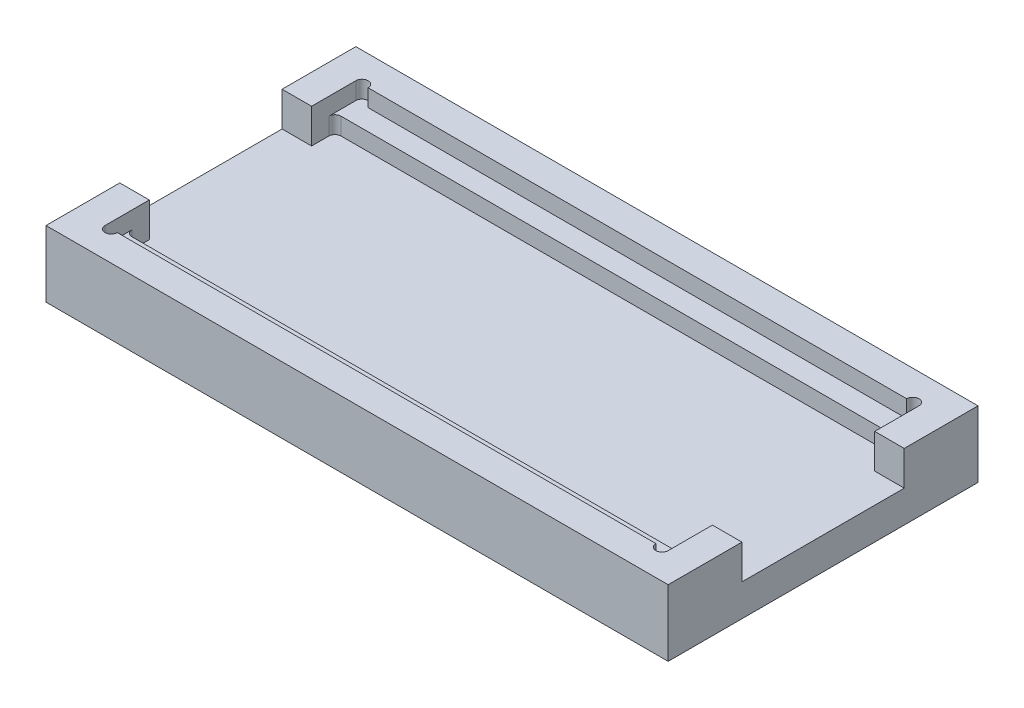
ISO-10303-21;
HEADER;
FILE_DESCRIPTION(('STEP AP214'),'2;1');
FILE_NAME('part.step','',(''),(''),'','','');
FILE_SCHEMA(('AUTOMOTIVE_DESIGN { 1 0 10303 214 1 1 1 1 }'));
ENDSEC;
DATA;
#1=APPLICATION_CONTEXT('core data for automotive mechanical design processes');
#2=APPLICATION_PROTOCOL_DEFINITION('international standard','automotive_design',2000,#1);
#3=PRODUCT_CONTEXT('',#1,'mechanical');
#4=PRODUCT('Part','Part','',(#3));
#5=PRODUCT_RELATED_PRODUCT_CATEGORY('part','',(#4));
#6=PRODUCT_DEFINITION_FORMATION('','',#4);
#7=PRODUCT_DEFINITION_CONTEXT('part definition',#1,'design');
#8=PRODUCT_DEFINITION('design','',#6,#7);
#9=PRODUCT_DEFINITION_SHAPE('','',#8);
#10=(LENGTH_UNIT() NAMED_UNIT(*) SI_UNIT(.MILLI.,.METRE.));
#11=(NAMED_UNIT(*) PLANE_ANGLE_UNIT() SI_UNIT($,.RADIAN.));
#12=(NAMED_UNIT(*) SI_UNIT($,.STERADIAN.) SOLID_ANGLE_UNIT());
#13=UNCERTAINTY_MEASURE_WITH_UNIT(LENGTH_MEASURE(1.E-05),#10,'distance_accuracy_value','');
#14=(GEOMETRIC_REPRESENTATION_CONTEXT(3) GLOBAL_UNCERTAINTY_ASSIGNED_CONTEXT((#13)) GLOBAL_UNIT_ASSIGNED_CONTEXT((#10,
#11,#12)) REPRESENTATION_CONTEXT('',''));
#15=CARTESIAN_POINT('',(0.,0.,0.));
#16=DIRECTION('',(0.,0.,1.));
#17=DIRECTION('',(1.,0.,0.));
#18=AXIS2_PLACEMENT_3D('',#15,#16,#17);
#19=CARTESIAN_POINT('',(0.,27.,0.));
#20=DIRECTION('',(0.,-1.,0.));
#21=DIRECTION('',(0.,0.,-1.));
#22=AXIS2_PLACEMENT_3D('',#19,#20,#21);
#23=PLANE('',#22);
#24=DIRECTION('',(0.,0.,-1.));
#25=VECTOR('',#24,1.);
#26=CARTESIAN_POINT('',(241.,27.,-114.));
#27=LINE('',#26,#25);
#28=CARTESIAN_POINT('',(241.,27.,-12.));
#29=VERTEX_POINT('',#28);
#30=CARTESIAN_POINT('',(241.,27.,-30.));
#31=VERTEX_POINT('',#30);
#32=EDGE_CURVE('E260',#29,#31,#27,.T.);
#33=ORIENTED_EDGE('',*,*,#32,.F.);
#34=CARTESIAN_POINT('',(238.5,27.,-12.));
#35=DIRECTION('',(0.,1.,0.));
#36=DIRECTION('',(0.,0.,-1.));
#37=AXIS2_PLACEMENT_3D('',#34,#35,#36);
#38=CIRCLE('',#37,2.5);
#39=CARTESIAN_POINT('',(236.,27.,-12.));
#40=VERTEX_POINT('',#39);
#41=EDGE_CURVE('E539',#40,#29,#38,.T.);
#42=ORIENTED_EDGE('',*,*,#41,.F.);
#43=DIRECTION('',(1.,0.,0.));
#44=VECTOR('',#43,1.);
#45=CARTESIAN_POINT('',(11.9999999999999,27.,-12.));
#46=LINE('',#45,#44);
#47=CARTESIAN_POINT('',(16.9999999999999,27.,-12.));
#48=VERTEX_POINT('',#47);
#49=EDGE_CURVE('E438',#48,#40,#46,.T.);
#50=ORIENTED_EDGE('',*,*,#49,.F.);
#51=CARTESIAN_POINT('',(14.4999999999999,27.,-12.));
#52=DIRECTION('',(0.,1.,0.));
#53=DIRECTION('',(0.,0.,1.));
#54=AXIS2_PLACEMENT_3D('',#51,#52,#53);
#55=CIRCLE('',#54,2.5);
#56=CARTESIAN_POINT('',(11.9999999999999,27.,-12.));
#57=VERTEX_POINT('',#56);
#58=EDGE_CURVE('E525',#57,#48,#55,.T.);
#59=ORIENTED_EDGE('',*,*,#58,.F.);
#60=DIRECTION('',(0.,0.,1.));
#61=VECTOR('',#60,1.);
#62=CARTESIAN_POINT('',(11.9999999999999,27.,-114.));
#63=LINE('',#62,#61);
#64=CARTESIAN_POINT('',(11.9999999999999,27.,-30.));
#65=VERTEX_POINT('',#64);
#66=EDGE_CURVE('E417',#65,#57,#63,.T.);
#67=ORIENTED_EDGE('',*,*,#66,.F.);
#68=DIRECTION('',(1.,0.,0.));
#69=VECTOR('',#68,1.);
#70=CARTESIAN_POINT('',(1.37667655053519E-13,27.,-30.));
#71=LINE('',#70,#69);
#72=CARTESIAN_POINT('',(1.37667655053519E-13,27.,-30.));
#73=VERTEX_POINT('',#72);
#74=EDGE_CURVE('E498',#73,#65,#71,.T.);
#75=ORIENTED_EDGE('',*,*,#74,.F.);
#76=DIRECTION('',(0.,0.,1.));
#77=VECTOR('',#76,1.);
#78=CARTESIAN_POINT('',(0.,27.,0.));
#79=LINE('',#78,#77);
#80=CARTESIAN_POINT('',(0.,27.,0.));
#81=VERTEX_POINT('',#80);
#82=EDGE_CURVE('E291',#73,#81,#79,.T.);
#83=ORIENTED_EDGE('',*,*,#82,.T.);
#84=DIRECTION('',(1.,0.,0.));
#85=VECTOR('',#84,1.);
#86=CARTESIAN_POINT('',(0.,27.,0.));
#87=LINE('',#86,#85);
#88=CARTESIAN_POINT('',(253.,27.,0.));
#89=VERTEX_POINT('',#88);
#90=EDGE_CURVE('E290',#81,#89,#87,.T.);
#91=ORIENTED_EDGE('',*,*,#90,.T.);
#92=DIRECTION('',(0.,0.,-1.));
#93=VECTOR('',#92,1.);
#94=CARTESIAN_POINT('',(253.,27.,0.));
#95=LINE('',#94,#93);
#96=CARTESIAN_POINT('',(253.,27.,-30.));
#97=VERTEX_POINT('',#96);
#98=EDGE_CURVE('E295',#89,#97,#95,.T.);
#99=ORIENTED_EDGE('',*,*,#98,.T.);
#100=DIRECTION('',(1.,0.,0.));
#101=VECTOR('',#100,1.);
#102=CARTESIAN_POINT('',(253.,27.,-30.));
#103=LINE('',#102,#101);
#104=EDGE_CURVE('E460',#31,#97,#103,.T.);
#105=ORIENTED_EDGE('',*,*,#104,.F.);
#106=EDGE_LOOP('',(#33,#42,#50,#59,#67,#75,#83,#91,#99,#105));
#107=FACE_BOUND('',#106,.T.);
#108=ADVANCED_FACE('F45',(#107),#23,.F.);
#109=CARTESIAN_POINT('',(241.,20.,-114.));
#110=DIRECTION('',(1.,0.,0.));
#111=DIRECTION('',(0.,0.,-1.));
#112=AXIS2_PLACEMENT_3D('',#109,#110,#111);
#113=PLANE('',#112);
#114=DIRECTION('',(0.,0.,-1.));
#115=VECTOR('',#114,1.);
#116=CARTESIAN_POINT('',(241.,13.,-105.5));
#117=LINE('',#116,#115);
#118=CARTESIAN_POINT('',(241.,13.,-23.));
#119=VERTEX_POINT('',#118);
#120=CARTESIAN_POINT('',(241.,13.,-30.));
#121=VERTEX_POINT('',#120);
#122=EDGE_CURVE('E411',#119,#121,#117,.T.);
#123=ORIENTED_EDGE('',*,*,#122,.F.);
#124=DIRECTION('',(0.,1.,0.));
#125=VECTOR('',#124,1.);
#126=CARTESIAN_POINT('',(241.,20.,-23.));
#127=LINE('',#126,#125);
#128=CARTESIAN_POINT('',(241.,20.,-23.));
#129=VERTEX_POINT('',#128);
#130=EDGE_CURVE('E330',#119,#129,#127,.T.);
#131=ORIENTED_EDGE('',*,*,#130,.T.);
#132=DIRECTION('',(0.,0.,-1.));
#133=VECTOR('',#132,1.);
#134=CARTESIAN_POINT('',(241.,20.,-114.));
#135=LINE('',#134,#133);
#136=CARTESIAN_POINT('',(241.,20.,-12.));
#137=VERTEX_POINT('',#136);
#138=EDGE_CURVE('E430',#137,#129,#135,.T.);
#139=ORIENTED_EDGE('',*,*,#138,.F.);
#140=DIRECTION('',(0.,1.,0.));
#141=VECTOR('',#140,1.);
#142=CARTESIAN_POINT('',(241.,20.,-12.));
#143=LINE('',#142,#141);
#144=EDGE_CURVE('E279',#137,#29,#143,.T.);
#145=ORIENTED_EDGE('',*,*,#144,.T.);
#146=ORIENTED_EDGE('',*,*,#32,.T.);
#147=DIRECTION('',(0.,1.,0.));
#148=VECTOR('',#147,1.);
#149=CARTESIAN_POINT('',(241.,13.,-30.));
#150=LINE('',#149,#148);
#151=EDGE_CURVE('E509',#121,#31,#150,.T.);
#152=ORIENTED_EDGE('',*,*,#151,.F.);
#153=EDGE_LOOP('',(#123,#131,#139,#145,#146,#152));
#154=FACE_BOUND('',#153,.T.);
#155=ADVANCED_FACE('F610',(#154),#113,.F.);
#156=CARTESIAN_POINT('',(11.9999999999999,20.,-114.));
#157=DIRECTION('',(-1.,0.,0.));
#158=DIRECTION('',(0.,0.,1.));
#159=AXIS2_PLACEMENT_3D('',#156,#157,#158);
#160=PLANE('',#159);
#161=DIRECTION('',(0.,0.,1.));
#162=VECTOR('',#161,1.);
#163=CARTESIAN_POINT('',(11.9999999999999,13.,-105.5));
#164=LINE('',#163,#162);
#165=CARTESIAN_POINT('',(11.9999999999999,13.,-103.));
#166=VERTEX_POINT('',#165);
#167=CARTESIAN_POINT('',(11.9999999999999,13.,-96.));
#168=VERTEX_POINT('',#167);
#169=EDGE_CURVE('E402',#166,#168,#164,.T.);
#170=ORIENTED_EDGE('',*,*,#169,.F.);
#171=DIRECTION('',(0.,1.,0.));
#172=VECTOR('',#171,1.);
#173=CARTESIAN_POINT('',(11.9999999999999,20.,-103.));
#174=LINE('',#173,#172);
#175=CARTESIAN_POINT('',(11.9999999999999,20.,-103.));
#176=VERTEX_POINT('',#175);
#177=EDGE_CURVE('E366',#166,#176,#174,.T.);
#178=ORIENTED_EDGE('',*,*,#177,.T.);
#179=DIRECTION('',(0.,0.,1.));
#180=VECTOR('',#179,1.);
#181=CARTESIAN_POINT('',(11.9999999999999,20.,-114.));
#182=LINE('',#181,#180);
#183=CARTESIAN_POINT('',(11.9999999999999,20.,-114.));
#184=VERTEX_POINT('',#183);
#185=EDGE_CURVE('E60',#184,#176,#182,.T.);
#186=ORIENTED_EDGE('',*,*,#185,.F.);
#187=DIRECTION('',(0.,1.,0.));
#188=VECTOR('',#187,1.);
#189=CARTESIAN_POINT('',(11.9999999999999,20.,-114.));
#190=LINE('',#189,#188);
#191=CARTESIAN_POINT('',(11.9999999999999,27.,-114.));
#192=VERTEX_POINT('',#191);
#193=EDGE_CURVE('E272',#184,#192,#190,.T.);
#194=ORIENTED_EDGE('',*,*,#193,.T.);
#195=CARTESIAN_POINT('',(11.9999999999999,27.,-96.));
#196=VERTEX_POINT('',#195);
#197=EDGE_CURVE('E435',#192,#196,#63,.T.);
#198=ORIENTED_EDGE('',*,*,#197,.T.);
#199=DIRECTION('',(0.,1.,0.));
#200=VECTOR('',#199,1.);
#201=CARTESIAN_POINT('',(11.9999999999999,13.,-96.));
#202=LINE('',#201,#200);
#203=EDGE_CURVE('E477',#168,#196,#202,.T.);
#204=ORIENTED_EDGE('',*,*,#203,.F.);
#205=EDGE_LOOP('',(#170,#178,#186,#194,#198,#204));
#206=FACE_BOUND('',#205,.T.);
#207=ADVANCED_FACE('F566',(#206),#160,.F.);
#208=CARTESIAN_POINT('',(0.,20.,0.));
#209=DIRECTION('',(0.,1.,0.));
#210=DIRECTION('',(0.,0.,1.));
#211=AXIS2_PLACEMENT_3D('',#208,#209,#210);
#212=PLANE('',#211);
#213=DIRECTION('',(-1.,0.,0.));
#214=VECTOR('',#213,1.);
#215=CARTESIAN_POINT('',(241.,20.,-105.5));
#216=LINE('',#215,#214);
#217=CARTESIAN_POINT('',(238.5,20.,-105.5));
#218=VERTEX_POINT('',#217);
#219=CARTESIAN_POINT('',(14.4999999999999,20.,-105.5));
#220=VERTEX_POINT('',#219);
#221=EDGE_CURVE('E418',#218,#220,#216,.T.);
#222=ORIENTED_EDGE('',*,*,#221,.F.);
#223=CARTESIAN_POINT('',(238.5,20.,-103.));
#224=DIRECTION('',(0.,1.,0.));
#225=DIRECTION('',(0.,0.,1.));
#226=AXIS2_PLACEMENT_3D('',#223,#224,#225);
#227=CIRCLE('',#226,2.5);
#228=CARTESIAN_POINT('',(241.,20.,-103.));
#229=VERTEX_POINT('',#228);
#230=EDGE_CURVE('E373',#218,#229,#227,.F.);
#231=ORIENTED_EDGE('',*,*,#230,.T.);
#232=CARTESIAN_POINT('',(241.,20.,-114.));
#233=VERTEX_POINT('',#232);
#234=EDGE_CURVE('E429',#229,#233,#135,.T.);
#235=ORIENTED_EDGE('',*,*,#234,.T.);
#236=CARTESIAN_POINT('',(238.5,20.,-114.));
#237=DIRECTION('',(0.,1.,0.));
#238=DIRECTION('',(0.,0.,1.));
#239=AXIS2_PLACEMENT_3D('',#236,#237,#238);
#240=CIRCLE('',#239,2.5);
#241=CARTESIAN_POINT('',(236.,20.,-114.));
#242=VERTEX_POINT('',#241);
#243=EDGE_CURVE('E253',#242,#233,#240,.F.);
#244=ORIENTED_EDGE('',*,*,#243,.F.);
#245=DIRECTION('',(-1.,0.,0.));
#246=VECTOR('',#245,1.);
#247=CARTESIAN_POINT('',(11.9999999999999,20.,-114.));
#248=LINE('',#247,#246);
#249=CARTESIAN_POINT('',(16.9999999999999,20.,-114.));
#250=VERTEX_POINT('',#249);
#251=EDGE_CURVE('E251',#242,#250,#248,.T.);
#252=ORIENTED_EDGE('',*,*,#251,.T.);
#253=CARTESIAN_POINT('',(14.4999999999999,20.,-114.));
#254=DIRECTION('',(0.,1.,0.));
#255=DIRECTION('',(0.,0.,1.));
#256=AXIS2_PLACEMENT_3D('',#253,#254,#255);
#257=CIRCLE('',#256,2.5);
#258=EDGE_CURVE('E534',#184,#250,#257,.F.);
#259=ORIENTED_EDGE('',*,*,#258,.F.);
#260=ORIENTED_EDGE('',*,*,#185,.T.);
#261=CARTESIAN_POINT('',(14.4999999999999,20.,-103.));
#262=DIRECTION('',(0.,1.,0.));
#263=DIRECTION('',(0.,0.,1.));
#264=AXIS2_PLACEMENT_3D('',#261,#262,#263);
#265=CIRCLE('',#264,2.5);
#266=EDGE_CURVE('E12',#176,#220,#265,.F.);
#267=ORIENTED_EDGE('',*,*,#266,.T.);
#268=EDGE_LOOP('',(#222,#231,#235,#244,#252,#259,#260,#267));
#269=FACE_BOUND('',#268,.T.);
#270=ADVANCED_FACE('F550',(#269),#212,.T.);
#271=CARTESIAN_POINT('',(0.,27.,0.));
#272=DIRECTION('',(1.,0.,0.));
#273=DIRECTION('',(0.,0.,-1.));
#274=AXIS2_PLACEMENT_3D('',#271,#272,#273);
#275=PLANE('',#274);
#276=DIRECTION('',(0.,0.,1.));
#277=VECTOR('',#276,1.);
#278=CARTESIAN_POINT('',(1.37667655053519E-13,13.,-30.));
#279=LINE('',#278,#277);
#280=CARTESIAN_POINT('',(0.,13.,-96.));
#281=VERTEX_POINT('',#280);
#282=CARTESIAN_POINT('',(1.37667655053519E-13,13.,-30.));
#283=VERTEX_POINT('',#282);
#284=EDGE_CURVE('E473',#281,#283,#279,.T.);
#285=ORIENTED_EDGE('',*,*,#284,.F.);
#286=DIRECTION('',(0.,1.,0.));
#287=VECTOR('',#286,1.);
#288=CARTESIAN_POINT('',(0.,13.,-96.));
#289=LINE('',#288,#287);
#290=CARTESIAN_POINT('',(0.,27.,-96.));
#291=VERTEX_POINT('',#290);
#292=EDGE_CURVE('E422',#281,#291,#289,.T.);
#293=ORIENTED_EDGE('',*,*,#292,.T.);
#294=CARTESIAN_POINT('',(0.,27.,-126.));
#295=VERTEX_POINT('',#294);
#296=EDGE_CURVE('E286',#295,#291,#79,.T.);
#297=ORIENTED_EDGE('',*,*,#296,.F.);
#298=DIRECTION('',(0.,-1.,0.));
#299=VECTOR('',#298,1.);
#300=CARTESIAN_POINT('',(0.,27.,-126.));
#301=LINE('',#300,#299);
#302=CARTESIAN_POINT('',(0.,0.,-126.));
#303=VERTEX_POINT('',#302);
#304=EDGE_CURVE('E302',#295,#303,#301,.T.);
#305=ORIENTED_EDGE('',*,*,#304,.T.);
#306=DIRECTION('',(0.,0.,1.));
#307=VECTOR('',#306,1.);
#308=CARTESIAN_POINT('',(0.,0.,0.));
#309=LINE('',#308,#307);
#310=CARTESIAN_POINT('',(0.,0.,0.));
#311=VERTEX_POINT('',#310);
#312=EDGE_CURVE('E276',#303,#311,#309,.T.);
#313=ORIENTED_EDGE('',*,*,#312,.T.);
#314=DIRECTION('',(0.,-1.,0.));
#315=VECTOR('',#314,1.);
#316=CARTESIAN_POINT('',(0.,27.,0.));
#317=LINE('',#316,#315);
#318=EDGE_CURVE('E326',#81,#311,#317,.T.);
#319=ORIENTED_EDGE('',*,*,#318,.F.);
#320=ORIENTED_EDGE('',*,*,#82,.F.);
#321=DIRECTION('',(0.,1.,0.));
#322=VECTOR('',#321,1.);
#323=CARTESIAN_POINT('',(1.37667655053519E-13,13.,-30.));
#324=LINE('',#323,#322);
#325=EDGE_CURVE('E489',#283,#73,#324,.T.);
#326=ORIENTED_EDGE('',*,*,#325,.F.);
#327=EDGE_LOOP('',(#285,#293,#297,#305,#313,#319,#320,#326));
#328=FACE_BOUND('',#327,.T.);
#329=ADVANCED_FACE('F575',(#328),#275,.F.);
#330=CARTESIAN_POINT('',(0.,27.,0.));
#331=DIRECTION('',(0.,0.,-1.));
#332=DIRECTION('',(-1.,0.,0.));
#333=AXIS2_PLACEMENT_3D('',#330,#331,#332);
#334=PLANE('',#333);
#335=DIRECTION('',(1.,0.,0.));
#336=VECTOR('',#335,1.);
#337=CARTESIAN_POINT('',(0.,0.,0.));
#338=LINE('',#337,#336);
#339=CARTESIAN_POINT('',(253.,0.,0.));
#340=VERTEX_POINT('',#339);
#341=EDGE_CURVE('E306',#311,#340,#338,.T.);
#342=ORIENTED_EDGE('',*,*,#341,.T.);
#343=DIRECTION('',(0.,-1.,0.));
#344=VECTOR('',#343,1.);
#345=CARTESIAN_POINT('',(253.,27.,0.));
#346=LINE('',#345,#344);
#347=EDGE_CURVE('E322',#89,#340,#346,.T.);
#348=ORIENTED_EDGE('',*,*,#347,.F.);
#349=ORIENTED_EDGE('',*,*,#90,.F.);
#350=ORIENTED_EDGE('',*,*,#318,.T.);
#351=EDGE_LOOP('',(#342,#348,#349,#350));
#352=FACE_BOUND('',#351,.T.);
#353=ADVANCED_FACE('F589',(#352),#334,.F.);
#354=CARTESIAN_POINT('',(253.,27.,0.));
#355=DIRECTION('',(-1.,0.,0.));
#356=DIRECTION('',(0.,0.,1.));
#357=AXIS2_PLACEMENT_3D('',#354,#355,#356);
#358=PLANE('',#357);
#359=DIRECTION('',(0.,0.,-1.));
#360=VECTOR('',#359,1.);
#361=CARTESIAN_POINT('',(253.,13.,-96.));
#362=LINE('',#361,#360);
#363=CARTESIAN_POINT('',(253.,13.,-30.));
#364=VERTEX_POINT('',#363);
#365=CARTESIAN_POINT('',(253.,13.,-96.));
#366=VERTEX_POINT('',#365);
#367=EDGE_CURVE('E515',#364,#366,#362,.T.);
#368=ORIENTED_EDGE('',*,*,#367,.F.);
#369=DIRECTION('',(0.,1.,0.));
#370=VECTOR('',#369,1.);
#371=CARTESIAN_POINT('',(253.,13.,-30.));
#372=LINE('',#371,#370);
#373=EDGE_CURVE('E500',#364,#97,#372,.T.);
#374=ORIENTED_EDGE('',*,*,#373,.T.);
#375=ORIENTED_EDGE('',*,*,#98,.F.);
#376=ORIENTED_EDGE('',*,*,#347,.T.);
#377=DIRECTION('',(0.,0.,-1.));
#378=VECTOR('',#377,1.);
#379=CARTESIAN_POINT('',(253.,0.,0.));
#380=LINE('',#379,#378);
#381=CARTESIAN_POINT('',(253.,0.,-126.));
#382=VERTEX_POINT('',#381);
#383=EDGE_CURVE('E309',#340,#382,#380,.T.);
#384=ORIENTED_EDGE('',*,*,#383,.T.);
#385=DIRECTION('',(0.,-1.,0.));
#386=VECTOR('',#385,1.);
#387=CARTESIAN_POINT('',(253.,27.,-126.));
#388=LINE('',#387,#386);
#389=CARTESIAN_POINT('',(253.,27.,-126.));
#390=VERTEX_POINT('',#389);
#391=EDGE_CURVE('E318',#390,#382,#388,.T.);
#392=ORIENTED_EDGE('',*,*,#391,.F.);
#393=CARTESIAN_POINT('',(253.,27.,-96.));
#394=VERTEX_POINT('',#393);
#395=EDGE_CURVE('E294',#394,#390,#95,.T.);
#396=ORIENTED_EDGE('',*,*,#395,.F.);
#397=DIRECTION('',(0.,1.,0.));
#398=VECTOR('',#397,1.);
#399=CARTESIAN_POINT('',(253.,13.,-96.));
#400=LINE('',#399,#398);
#401=EDGE_CURVE('E467',#366,#394,#400,.T.);
#402=ORIENTED_EDGE('',*,*,#401,.F.);
#403=EDGE_LOOP('',(#368,#374,#375,#376,#384,#392,#396,#402));
#404=FACE_BOUND('',#403,.T.);
#405=ADVANCED_FACE('F466',(#404),#358,.F.);
#406=CARTESIAN_POINT('',(0.,27.,-126.));
#407=DIRECTION('',(0.,0.,1.));
#408=DIRECTION('',(1.,0.,0.));
#409=AXIS2_PLACEMENT_3D('',#406,#407,#408);
#410=PLANE('',#409);
#411=DIRECTION('',(-1.,0.,0.));
#412=VECTOR('',#411,1.);
#413=CARTESIAN_POINT('',(0.,0.,-126.));
#414=LINE('',#413,#412);
#415=EDGE_CURVE('E312',#382,#303,#414,.T.);
#416=ORIENTED_EDGE('',*,*,#415,.T.);
#417=ORIENTED_EDGE('',*,*,#304,.F.);
#418=DIRECTION('',(-1.,0.,0.));
#419=VECTOR('',#418,1.);
#420=CARTESIAN_POINT('',(0.,27.,-126.));
#421=LINE('',#420,#419);
#422=EDGE_CURVE('E299',#390,#295,#421,.T.);
#423=ORIENTED_EDGE('',*,*,#422,.F.);
#424=ORIENTED_EDGE('',*,*,#391,.T.);
#425=EDGE_LOOP('',(#416,#417,#423,#424));
#426=FACE_BOUND('',#425,.T.);
#427=ADVANCED_FACE('F579',(#426),#410,.F.);
#428=ORIENTED_EDGE('',*,*,#197,.F.);
#429=CARTESIAN_POINT('',(14.4999999999999,27.,-114.));
#430=DIRECTION('',(0.,1.,0.));
#431=DIRECTION('',(0.,0.,-1.));
#432=AXIS2_PLACEMENT_3D('',#429,#430,#431);
#433=CIRCLE('',#432,2.5);
#434=CARTESIAN_POINT('',(16.9999999999999,27.,-114.));
#435=VERTEX_POINT('',#434);
#436=EDGE_CURVE('E258',#435,#192,#433,.T.);
#437=ORIENTED_EDGE('',*,*,#436,.F.);
#438=DIRECTION('',(-1.,0.,0.));
#439=VECTOR('',#438,1.);
#440=CARTESIAN_POINT('',(11.9999999999999,27.,-114.));
#441=LINE('',#440,#439);
#442=CARTESIAN_POINT('',(236.,27.,-114.));
#443=VERTEX_POINT('',#442);
#444=EDGE_CURVE('E249',#443,#435,#441,.T.);
#445=ORIENTED_EDGE('',*,*,#444,.F.);
#446=CARTESIAN_POINT('',(238.5,27.,-114.));
#447=DIRECTION('',(0.,1.,0.));
#448=DIRECTION('',(0.,0.,1.));
#449=AXIS2_PLACEMENT_3D('',#446,#447,#448);
#450=CIRCLE('',#449,2.5);
#451=CARTESIAN_POINT('',(241.,27.,-114.));
#452=VERTEX_POINT('',#451);
#453=EDGE_CURVE('E232',#452,#443,#450,.T.);
#454=ORIENTED_EDGE('',*,*,#453,.F.);
#455=CARTESIAN_POINT('',(241.,27.,-96.));
#456=VERTEX_POINT('',#455);
#457=EDGE_CURVE('E268',#456,#452,#27,.T.);
#458=ORIENTED_EDGE('',*,*,#457,.F.);
#459=DIRECTION('',(-1.,0.,0.));
#460=VECTOR('',#459,1.);
#461=CARTESIAN_POINT('',(253.,27.,-96.));
#462=LINE('',#461,#460);
#463=EDGE_CURVE('E455',#394,#456,#462,.T.);
#464=ORIENTED_EDGE('',*,*,#463,.F.);
#465=ORIENTED_EDGE('',*,*,#395,.T.);
#466=ORIENTED_EDGE('',*,*,#422,.T.);
#467=ORIENTED_EDGE('',*,*,#296,.T.);
#468=DIRECTION('',(-1.,0.,0.));
#469=VECTOR('',#468,1.);
#470=CARTESIAN_POINT('',(0.,27.,-96.));
#471=LINE('',#470,#469);
#472=EDGE_CURVE('E475',#196,#291,#471,.T.);
#473=ORIENTED_EDGE('',*,*,#472,.F.);
#474=EDGE_LOOP('',(#428,#437,#445,#454,#458,#464,#465,#466,#467,#473));
#475=FACE_BOUND('',#474,.T.);
#476=ADVANCED_FACE('F257',(#475),#23,.F.);
#477=CARTESIAN_POINT('',(0.,0.,0.));
#478=DIRECTION('',(0.,-1.,0.));
#479=DIRECTION('',(0.,0.,-1.));
#480=AXIS2_PLACEMENT_3D('',#477,#478,#479);
#481=PLANE('',#480);
#482=ORIENTED_EDGE('',*,*,#312,.F.);
#483=ORIENTED_EDGE('',*,*,#415,.F.);
#484=ORIENTED_EDGE('',*,*,#383,.F.);
#485=ORIENTED_EDGE('',*,*,#341,.F.);
#486=EDGE_LOOP('',(#482,#483,#484,#485));
#487=FACE_BOUND('',#486,.T.);
#488=ADVANCED_FACE('F584',(#487),#481,.T.);
#489=CARTESIAN_POINT('',(11.9999999999999,20.,-23.));
#490=VERTEX_POINT('',#489);
#491=CARTESIAN_POINT('',(11.9999999999999,20.,-12.));
#492=VERTEX_POINT('',#491);
#493=EDGE_CURVE('E68',#490,#492,#182,.T.);
#494=ORIENTED_EDGE('',*,*,#493,.F.);
#495=DIRECTION('',(0.,1.,0.));
#496=VECTOR('',#495,1.);
#497=CARTESIAN_POINT('',(11.9999999999999,13.,-23.));
#498=LINE('',#497,#496);
#499=CARTESIAN_POINT('',(11.9999999999999,13.,-23.));
#500=VERTEX_POINT('',#499);
#501=EDGE_CURVE('E363',#490,#500,#498,.F.);
#502=ORIENTED_EDGE('',*,*,#501,.T.);
#503=CARTESIAN_POINT('',(11.9999999999999,13.,-30.));
#504=VERTEX_POINT('',#503);
#505=EDGE_CURVE('E393',#504,#500,#164,.T.);
#506=ORIENTED_EDGE('',*,*,#505,.F.);
#507=DIRECTION('',(0.,1.,0.));
#508=VECTOR('',#507,1.);
#509=CARTESIAN_POINT('',(11.9999999999999,13.,-30.));
#510=LINE('',#509,#508);
#511=EDGE_CURVE('E479',#504,#65,#510,.T.);
#512=ORIENTED_EDGE('',*,*,#511,.T.);
#513=ORIENTED_EDGE('',*,*,#66,.T.);
#514=DIRECTION('',(0.,1.,0.));
#515=VECTOR('',#514,1.);
#516=CARTESIAN_POINT('',(11.9999999999999,20.,-12.));
#517=LINE('',#516,#515);
#518=EDGE_CURVE('E283',#492,#57,#517,.T.);
#519=ORIENTED_EDGE('',*,*,#518,.F.);
#520=EDGE_LOOP('',(#494,#502,#506,#512,#513,#519));
#521=FACE_BOUND('',#520,.T.);
#522=ADVANCED_FACE('F391',(#521),#160,.F.);
#523=CARTESIAN_POINT('',(11.9999999999999,20.,-114.));
#524=DIRECTION('',(0.,0.,-1.));
#525=DIRECTION('',(-1.,0.,0.));
#526=AXIS2_PLACEMENT_3D('',#523,#524,#525);
#527=PLANE('',#526);
#528=ORIENTED_EDGE('',*,*,#444,.T.);
#529=DIRECTION('',(0.,1.,0.));
#530=VECTOR('',#529,1.);
#531=CARTESIAN_POINT('',(16.9999999999999,14.4098300562505,-114.));
#532=LINE('',#531,#530);
#533=EDGE_CURVE('E531',#250,#435,#532,.T.);
#534=ORIENTED_EDGE('',*,*,#533,.F.);
#535=ORIENTED_EDGE('',*,*,#251,.F.);
#536=DIRECTION('',(0.,1.,0.));
#537=VECTOR('',#536,1.);
#538=CARTESIAN_POINT('',(236.,14.4098300562505,-114.));
#539=LINE('',#538,#537);
#540=EDGE_CURVE('E235',#242,#443,#539,.T.);
#541=ORIENTED_EDGE('',*,*,#540,.T.);
#542=EDGE_LOOP('',(#528,#534,#535,#541));
#543=FACE_BOUND('',#542,.T.);
#544=ADVANCED_FACE('F247',(#543),#527,.F.);
#545=ORIENTED_EDGE('',*,*,#234,.F.);
#546=DIRECTION('',(0.,1.,0.));
#547=VECTOR('',#546,1.);
#548=CARTESIAN_POINT('',(241.,13.,-103.));
#549=LINE('',#548,#547);
#550=CARTESIAN_POINT('',(241.,13.,-103.));
#551=VERTEX_POINT('',#550);
#552=EDGE_CURVE('E360',#229,#551,#549,.F.);
#553=ORIENTED_EDGE('',*,*,#552,.T.);
#554=CARTESIAN_POINT('',(241.,13.,-96.));
#555=VERTEX_POINT('',#554);
#556=EDGE_CURVE('E423',#555,#551,#117,.T.);
#557=ORIENTED_EDGE('',*,*,#556,.F.);
#558=DIRECTION('',(0.,1.,0.));
#559=VECTOR('',#558,1.);
#560=CARTESIAN_POINT('',(241.,13.,-96.));
#561=LINE('',#560,#559);
#562=EDGE_CURVE('E453',#555,#456,#561,.T.);
#563=ORIENTED_EDGE('',*,*,#562,.T.);
#564=ORIENTED_EDGE('',*,*,#457,.T.);
#565=DIRECTION('',(0.,1.,0.));
#566=VECTOR('',#565,1.);
#567=CARTESIAN_POINT('',(241.,20.,-114.));
#568=LINE('',#567,#566);
#569=EDGE_CURVE('E238',#233,#452,#568,.T.);
#570=ORIENTED_EDGE('',*,*,#569,.F.);
#571=EDGE_LOOP('',(#545,#553,#557,#563,#564,#570));
#572=FACE_BOUND('',#571,.T.);
#573=ADVANCED_FACE('F450',(#572),#113,.F.);
#574=CARTESIAN_POINT('',(11.9999999999999,20.,-12.));
#575=DIRECTION('',(0.,0.,1.));
#576=DIRECTION('',(1.,0.,0.));
#577=AXIS2_PLACEMENT_3D('',#574,#575,#576);
#578=PLANE('',#577);
#579=ORIENTED_EDGE('',*,*,#49,.T.);
#580=DIRECTION('',(0.,1.,0.));
#581=VECTOR('',#580,1.);
#582=CARTESIAN_POINT('',(236.,14.4098300562505,-12.));
#583=LINE('',#582,#581);
#584=CARTESIAN_POINT('',(236.,20.,-12.));
#585=VERTEX_POINT('',#584);
#586=EDGE_CURVE('E540',#585,#40,#583,.T.);
#587=ORIENTED_EDGE('',*,*,#586,.F.);
#588=DIRECTION('',(1.,0.,0.));
#589=VECTOR('',#588,1.);
#590=CARTESIAN_POINT('',(11.9999999999999,20.,-12.));
#591=LINE('',#590,#589);
#592=CARTESIAN_POINT('',(16.9999999999999,20.,-12.));
#593=VERTEX_POINT('',#592);
#594=EDGE_CURVE('E426',#593,#585,#591,.T.);
#595=ORIENTED_EDGE('',*,*,#594,.F.);
#596=DIRECTION('',(0.,1.,0.));
#597=VECTOR('',#596,1.);
#598=CARTESIAN_POINT('',(16.9999999999999,14.4098300562505,-12.));
#599=LINE('',#598,#597);
#600=EDGE_CURVE('E471',#593,#48,#599,.T.);
#601=ORIENTED_EDGE('',*,*,#600,.T.);
#602=EDGE_LOOP('',(#579,#587,#595,#601));
#603=FACE_BOUND('',#602,.T.);
#604=ADVANCED_FACE('F760',(#603),#578,.F.);
#605=DIRECTION('',(1.,0.,0.));
#606=VECTOR('',#605,1.);
#607=CARTESIAN_POINT('',(241.,20.,-20.5));
#608=LINE('',#607,#606);
#609=CARTESIAN_POINT('',(14.4999999999999,20.,-20.5));
#610=VERTEX_POINT('',#609);
#611=CARTESIAN_POINT('',(238.5,20.,-20.5));
#612=VERTEX_POINT('',#611);
#613=EDGE_CURVE('E384',#610,#612,#608,.T.);
#614=ORIENTED_EDGE('',*,*,#613,.F.);
#615=CARTESIAN_POINT('',(14.4999999999999,20.,-23.));
#616=DIRECTION('',(0.,1.,0.));
#617=DIRECTION('',(0.,0.,1.));
#618=AXIS2_PLACEMENT_3D('',#615,#616,#617);
#619=CIRCLE('',#618,2.5);
#620=EDGE_CURVE('E54',#610,#490,#619,.F.);
#621=ORIENTED_EDGE('',*,*,#620,.T.);
#622=ORIENTED_EDGE('',*,*,#493,.T.);
#623=CARTESIAN_POINT('',(14.4999999999999,20.,-12.));
#624=DIRECTION('',(0.,1.,0.));
#625=DIRECTION('',(0.,0.,1.));
#626=AXIS2_PLACEMENT_3D('',#623,#624,#625);
#627=CIRCLE('',#626,2.5);
#628=EDGE_CURVE('E461',#593,#492,#627,.F.);
#629=ORIENTED_EDGE('',*,*,#628,.F.);
#630=ORIENTED_EDGE('',*,*,#594,.T.);
#631=CARTESIAN_POINT('',(238.5,20.,-12.));
#632=DIRECTION('',(0.,1.,0.));
#633=DIRECTION('',(0.,0.,1.));
#634=AXIS2_PLACEMENT_3D('',#631,#632,#633);
#635=CIRCLE('',#634,2.5);
#636=EDGE_CURVE('E528',#137,#585,#635,.F.);
#637=ORIENTED_EDGE('',*,*,#636,.F.);
#638=ORIENTED_EDGE('',*,*,#138,.T.);
#639=CARTESIAN_POINT('',(238.5,20.,-23.));
#640=DIRECTION('',(0.,1.,0.));
#641=DIRECTION('',(0.,0.,1.));
#642=AXIS2_PLACEMENT_3D('',#639,#640,#641);
#643=CIRCLE('',#642,2.5);
#644=EDGE_CURVE('E370',#129,#612,#643,.F.);
#645=ORIENTED_EDGE('',*,*,#644,.T.);
#646=EDGE_LOOP('',(#614,#621,#622,#629,#630,#637,#638,#645));
#647=FACE_BOUND('',#646,.T.);
#648=ADVANCED_FACE('F381',(#647),#212,.T.);
#649=CARTESIAN_POINT('',(241.,13.,-20.5));
#650=DIRECTION('',(0.,0.,1.));
#651=DIRECTION('',(1.,0.,0.));
#652=AXIS2_PLACEMENT_3D('',#649,#650,#651);
#653=PLANE('',#652);
#654=ORIENTED_EDGE('',*,*,#613,.T.);
#655=DIRECTION('',(0.,1.,0.));
#656=VECTOR('',#655,1.);
#657=CARTESIAN_POINT('',(238.5,13.,-20.5));
#658=LINE('',#657,#656);
#659=CARTESIAN_POINT('',(238.5,13.,-20.5));
#660=VERTEX_POINT('',#659);
#661=EDGE_CURVE('E338',#612,#660,#658,.F.);
#662=ORIENTED_EDGE('',*,*,#661,.T.);
#663=DIRECTION('',(1.,0.,0.));
#664=VECTOR('',#663,1.);
#665=CARTESIAN_POINT('',(241.,13.,-20.5));
#666=LINE('',#665,#664);
#667=CARTESIAN_POINT('',(14.4999999999999,13.,-20.5));
#668=VERTEX_POINT('',#667);
#669=EDGE_CURVE('E408',#668,#660,#666,.T.);
#670=ORIENTED_EDGE('',*,*,#669,.F.);
#671=DIRECTION('',(0.,1.,0.));
#672=VECTOR('',#671,1.);
#673=CARTESIAN_POINT('',(14.4999999999999,20.,-20.5));
#674=LINE('',#673,#672);
#675=EDGE_CURVE('E334',#668,#610,#674,.T.);
#676=ORIENTED_EDGE('',*,*,#675,.T.);
#677=EDGE_LOOP('',(#654,#662,#670,#676));
#678=FACE_BOUND('',#677,.T.);
#679=ADVANCED_FACE('F619',(#678),#653,.F.);
#680=CARTESIAN_POINT('',(241.,13.,-105.5));
#681=DIRECTION('',(0.,0.,-1.));
#682=DIRECTION('',(-1.,0.,0.));
#683=AXIS2_PLACEMENT_3D('',#680,#681,#682);
#684=PLANE('',#683);
#685=DIRECTION('',(-1.,0.,0.));
#686=VECTOR('',#685,1.);
#687=CARTESIAN_POINT('',(241.,13.,-105.5));
#688=LINE('',#687,#686);
#689=CARTESIAN_POINT('',(238.5,13.,-105.5));
#690=VERTEX_POINT('',#689);
#691=CARTESIAN_POINT('',(14.4999999999999,13.,-105.5));
#692=VERTEX_POINT('',#691);
#693=EDGE_CURVE('E403',#690,#692,#688,.T.);
#694=ORIENTED_EDGE('',*,*,#693,.F.);
#695=DIRECTION('',(0.,1.,0.));
#696=VECTOR('',#695,1.);
#697=CARTESIAN_POINT('',(238.5,20.,-105.5));
#698=LINE('',#697,#696);
#699=EDGE_CURVE('E356',#690,#218,#698,.T.);
#700=ORIENTED_EDGE('',*,*,#699,.T.);
#701=ORIENTED_EDGE('',*,*,#221,.T.);
#702=DIRECTION('',(0.,1.,0.));
#703=VECTOR('',#702,1.);
#704=CARTESIAN_POINT('',(14.4999999999999,13.,-105.5));
#705=LINE('',#704,#703);
#706=EDGE_CURVE('E353',#220,#692,#705,.F.);
#707=ORIENTED_EDGE('',*,*,#706,.T.);
#708=EDGE_LOOP('',(#694,#700,#701,#707));
#709=FACE_BOUND('',#708,.T.);
#710=ADVANCED_FACE('F559',(#709),#684,.F.);
#711=CARTESIAN_POINT('',(0.,13.,0.));
#712=DIRECTION('',(0.,-1.,0.));
#713=DIRECTION('',(0.,0.,-1.));
#714=AXIS2_PLACEMENT_3D('',#711,#712,#713);
#715=PLANE('',#714);
#716=ORIENTED_EDGE('',*,*,#669,.T.);
#717=CARTESIAN_POINT('',(238.5,13.,-23.));
#718=DIRECTION('',(0.,-1.,0.));
#719=DIRECTION('',(0.,0.,-1.));
#720=AXIS2_PLACEMENT_3D('',#717,#718,#719);
#721=CIRCLE('',#720,2.5);
#722=EDGE_CURVE('E350',#660,#119,#721,.F.);
#723=ORIENTED_EDGE('',*,*,#722,.T.);
#724=ORIENTED_EDGE('',*,*,#122,.T.);
#725=DIRECTION('',(1.,0.,0.));
#726=VECTOR('',#725,1.);
#727=CARTESIAN_POINT('',(253.,13.,-30.));
#728=LINE('',#727,#726);
#729=EDGE_CURVE('E506',#121,#364,#728,.T.);
#730=ORIENTED_EDGE('',*,*,#729,.T.);
#731=ORIENTED_EDGE('',*,*,#367,.T.);
#732=DIRECTION('',(-1.,0.,0.));
#733=VECTOR('',#732,1.);
#734=CARTESIAN_POINT('',(253.,13.,-96.));
#735=LINE('',#734,#733);
#736=EDGE_CURVE('E519',#366,#555,#735,.T.);
#737=ORIENTED_EDGE('',*,*,#736,.T.);
#738=ORIENTED_EDGE('',*,*,#556,.T.);
#739=CARTESIAN_POINT('',(238.5,13.,-103.));
#740=DIRECTION('',(0.,-1.,0.));
#741=DIRECTION('',(0.,0.,-1.));
#742=AXIS2_PLACEMENT_3D('',#739,#740,#741);
#743=CIRCLE('',#742,2.5);
#744=EDGE_CURVE('E347',#551,#690,#743,.F.);
#745=ORIENTED_EDGE('',*,*,#744,.T.);
#746=ORIENTED_EDGE('',*,*,#693,.T.);
#747=CARTESIAN_POINT('',(14.4999999999999,13.,-103.));
#748=DIRECTION('',(0.,-1.,0.));
#749=DIRECTION('',(0.,0.,-1.));
#750=AXIS2_PLACEMENT_3D('',#747,#748,#749);
#751=CIRCLE('',#750,2.5);
#752=EDGE_CURVE('E341',#692,#166,#751,.F.);
#753=ORIENTED_EDGE('',*,*,#752,.T.);
#754=ORIENTED_EDGE('',*,*,#169,.T.);
#755=DIRECTION('',(-1.,0.,0.));
#756=VECTOR('',#755,1.);
#757=CARTESIAN_POINT('',(0.,13.,-96.));
#758=LINE('',#757,#756);
#759=EDGE_CURVE('E481',#168,#281,#758,.T.);
#760=ORIENTED_EDGE('',*,*,#759,.T.);
#761=ORIENTED_EDGE('',*,*,#284,.T.);
#762=DIRECTION('',(1.,0.,0.));
#763=VECTOR('',#762,1.);
#764=CARTESIAN_POINT('',(1.37667655053519E-13,13.,-30.));
#765=LINE('',#764,#763);
#766=EDGE_CURVE('E399',#283,#504,#765,.T.);
#767=ORIENTED_EDGE('',*,*,#766,.T.);
#768=ORIENTED_EDGE('',*,*,#505,.T.);
#769=CARTESIAN_POINT('',(14.4999999999999,13.,-23.));
#770=DIRECTION('',(0.,-1.,0.));
#771=DIRECTION('',(0.,0.,-1.));
#772=AXIS2_PLACEMENT_3D('',#769,#770,#771);
#773=CIRCLE('',#772,2.5);
#774=EDGE_CURVE('E344',#500,#668,#773,.F.);
#775=ORIENTED_EDGE('',*,*,#774,.T.);
#776=EDGE_LOOP('',(#716,#723,#724,#730,#731,#737,#738,#745,#746,#753,#754,#760,#761,#767,#768,#775));
#777=FACE_BOUND('',#776,.T.);
#778=ADVANCED_FACE('F396',(#777),#715,.F.);
#779=CARTESIAN_POINT('',(0.,13.,-96.));
#780=DIRECTION('',(0.,0.,-1.));
#781=DIRECTION('',(-1.,0.,0.));
#782=AXIS2_PLACEMENT_3D('',#779,#780,#781);
#783=PLANE('',#782);
#784=ORIENTED_EDGE('',*,*,#472,.T.);
#785=ORIENTED_EDGE('',*,*,#292,.F.);
#786=ORIENTED_EDGE('',*,*,#759,.F.);
#787=ORIENTED_EDGE('',*,*,#203,.T.);
#788=EDGE_LOOP('',(#784,#785,#786,#787));
#789=FACE_BOUND('',#788,.T.);
#790=ADVANCED_FACE('F571',(#789),#783,.F.);
#791=CARTESIAN_POINT('',(1.37667655053519E-13,13.,-30.));
#792=DIRECTION('',(0.,0.,1.));
#793=DIRECTION('',(1.,0.,0.));
#794=AXIS2_PLACEMENT_3D('',#791,#792,#793);
#795=PLANE('',#794);
#796=ORIENTED_EDGE('',*,*,#74,.T.);
#797=ORIENTED_EDGE('',*,*,#511,.F.);
#798=ORIENTED_EDGE('',*,*,#766,.F.);
#799=ORIENTED_EDGE('',*,*,#325,.T.);
#800=EDGE_LOOP('',(#796,#797,#798,#799));
#801=FACE_BOUND('',#800,.T.);
#802=ADVANCED_FACE('F599',(#801),#795,.F.);
#803=CARTESIAN_POINT('',(253.,13.,-30.));
#804=DIRECTION('',(0.,0.,1.));
#805=DIRECTION('',(1.,0.,0.));
#806=AXIS2_PLACEMENT_3D('',#803,#804,#805);
#807=PLANE('',#806);
#808=ORIENTED_EDGE('',*,*,#104,.T.);
#809=ORIENTED_EDGE('',*,*,#373,.F.);
#810=ORIENTED_EDGE('',*,*,#729,.F.);
#811=ORIENTED_EDGE('',*,*,#151,.T.);
#812=EDGE_LOOP('',(#808,#809,#810,#811));
#813=FACE_BOUND('',#812,.T.);
#814=ADVANCED_FACE('F621',(#813),#807,.F.);
#815=CARTESIAN_POINT('',(253.,13.,-96.));
#816=DIRECTION('',(0.,0.,-1.));
#817=DIRECTION('',(-1.,0.,0.));
#818=AXIS2_PLACEMENT_3D('',#815,#816,#817);
#819=PLANE('',#818);
#820=ORIENTED_EDGE('',*,*,#463,.T.);
#821=ORIENTED_EDGE('',*,*,#562,.F.);
#822=ORIENTED_EDGE('',*,*,#736,.F.);
#823=ORIENTED_EDGE('',*,*,#401,.T.);
#824=EDGE_LOOP('',(#820,#821,#822,#823));
#825=FACE_BOUND('',#824,.T.);
#826=ADVANCED_FACE('F624',(#825),#819,.F.);
#827=CARTESIAN_POINT('',(14.4999999999999,14.4098300562505,-12.));
#828=DIRECTION('',(0.,1.,0.));
#829=DIRECTION('',(0.,0.,1.));
#830=AXIS2_PLACEMENT_3D('',#827,#828,#829);
#831=CYLINDRICAL_SURFACE('',#830,2.5);
#832=ORIENTED_EDGE('',*,*,#628,.T.);
#833=ORIENTED_EDGE('',*,*,#518,.T.);
#834=ORIENTED_EDGE('',*,*,#58,.T.);
#835=ORIENTED_EDGE('',*,*,#600,.F.);
#836=EDGE_LOOP('',(#832,#833,#834,#835));
#837=FACE_BOUND('',#836,.T.);
#838=ADVANCED_FACE('F602',(#837),#831,.F.);
#839=CARTESIAN_POINT('',(238.5,14.4098300562505,-12.));
#840=DIRECTION('',(0.,1.,0.));
#841=DIRECTION('',(0.,0.,1.));
#842=AXIS2_PLACEMENT_3D('',#839,#840,#841);
#843=CYLINDRICAL_SURFACE('',#842,2.5);
#844=ORIENTED_EDGE('',*,*,#636,.T.);
#845=ORIENTED_EDGE('',*,*,#586,.T.);
#846=ORIENTED_EDGE('',*,*,#41,.T.);
#847=ORIENTED_EDGE('',*,*,#144,.F.);
#848=EDGE_LOOP('',(#844,#845,#846,#847));
#849=FACE_BOUND('',#848,.T.);
#850=ADVANCED_FACE('F606',(#849),#843,.F.);
#851=CARTESIAN_POINT('',(238.5,14.4098300562505,-114.));
#852=DIRECTION('',(0.,1.,0.));
#853=DIRECTION('',(0.,0.,1.));
#854=AXIS2_PLACEMENT_3D('',#851,#852,#853);
#855=CYLINDRICAL_SURFACE('',#854,2.5);
#856=ORIENTED_EDGE('',*,*,#243,.T.);
#857=ORIENTED_EDGE('',*,*,#569,.T.);
#858=ORIENTED_EDGE('',*,*,#453,.T.);
#859=ORIENTED_EDGE('',*,*,#540,.F.);
#860=EDGE_LOOP('',(#856,#857,#858,#859));
#861=FACE_BOUND('',#860,.T.);
#862=ADVANCED_FACE('F234',(#861),#855,.F.);
#863=CARTESIAN_POINT('',(14.4999999999999,14.4098300562505,-114.));
#864=DIRECTION('',(0.,1.,0.));
#865=DIRECTION('',(0.,0.,1.));
#866=AXIS2_PLACEMENT_3D('',#863,#864,#865);
#867=CYLINDRICAL_SURFACE('',#866,2.5);
#868=ORIENTED_EDGE('',*,*,#258,.T.);
#869=ORIENTED_EDGE('',*,*,#533,.T.);
#870=ORIENTED_EDGE('',*,*,#436,.T.);
#871=ORIENTED_EDGE('',*,*,#193,.F.);
#872=EDGE_LOOP('',(#868,#869,#870,#871));
#873=FACE_BOUND('',#872,.T.);
#874=ADVANCED_FACE('F658',(#873),#867,.F.);
#875=CARTESIAN_POINT('',(238.5,20.,-23.));
#876=DIRECTION('',(0.,-1.,0.));
#877=DIRECTION('',(0.,0.,-1.));
#878=AXIS2_PLACEMENT_3D('',#875,#876,#877);
#879=CYLINDRICAL_SURFACE('',#878,2.5);
#880=ORIENTED_EDGE('',*,*,#722,.F.);
#881=ORIENTED_EDGE('',*,*,#661,.F.);
#882=ORIENTED_EDGE('',*,*,#644,.F.);
#883=ORIENTED_EDGE('',*,*,#130,.F.);
#884=EDGE_LOOP('',(#880,#881,#882,#883));
#885=FACE_BOUND('',#884,.T.);
#886=ADVANCED_FACE('F617',(#885),#879,.F.);
#887=CARTESIAN_POINT('',(238.5,13.,-103.));
#888=DIRECTION('',(0.,-1.,0.));
#889=DIRECTION('',(0.,0.,-1.));
#890=AXIS2_PLACEMENT_3D('',#887,#888,#889);
#891=CYLINDRICAL_SURFACE('',#890,2.5);
#892=ORIENTED_EDGE('',*,*,#744,.F.);
#893=ORIENTED_EDGE('',*,*,#552,.F.);
#894=ORIENTED_EDGE('',*,*,#230,.F.);
#895=ORIENTED_EDGE('',*,*,#699,.F.);
#896=EDGE_LOOP('',(#892,#893,#894,#895));
#897=FACE_BOUND('',#896,.T.);
#898=ADVANCED_FACE('F557',(#897),#891,.F.);
#899=CARTESIAN_POINT('',(14.4999999999999,13.,-23.));
#900=DIRECTION('',(0.,-1.,0.));
#901=DIRECTION('',(0.,0.,-1.));
#902=AXIS2_PLACEMENT_3D('',#899,#900,#901);
#903=CYLINDRICAL_SURFACE('',#902,2.5);
#904=ORIENTED_EDGE('',*,*,#774,.F.);
#905=ORIENTED_EDGE('',*,*,#501,.F.);
#906=ORIENTED_EDGE('',*,*,#620,.F.);
#907=ORIENTED_EDGE('',*,*,#675,.F.);
#908=EDGE_LOOP('',(#904,#905,#906,#907));
#909=FACE_BOUND('',#908,.T.);
#910=ADVANCED_FACE('F388',(#909),#903,.F.);
#911=CARTESIAN_POINT('',(14.4999999999999,20.,-103.));
#912=DIRECTION('',(0.,-1.,0.));
#913=DIRECTION('',(0.,0.,-1.));
#914=AXIS2_PLACEMENT_3D('',#911,#912,#913);
#915=CYLINDRICAL_SURFACE('',#914,2.5);
#916=ORIENTED_EDGE('',*,*,#752,.F.);
#917=ORIENTED_EDGE('',*,*,#706,.F.);
#918=ORIENTED_EDGE('',*,*,#266,.F.);
#919=ORIENTED_EDGE('',*,*,#177,.F.);
#920=EDGE_LOOP('',(#916,#917,#918,#919));
#921=FACE_BOUND('',#920,.T.);
#922=ADVANCED_FACE('F47',(#921),#915,.F.);
#923=CLOSED_SHELL('',(#108,#155,#207,#270,#329,#353,#405,#427,#476,#488,#522,#544,#573,#604,
#648,#679,#710,#778,#790,#802,#814,#826,#838,#850,#862,#874,#886,#898,#910,#922));
#924=MANIFOLD_SOLID_BREP('B2',#923);
#925=ADVANCED_BREP_SHAPE_REPRESENTATION('',(#18,#924),#14);
#926=SHAPE_DEFINITION_REPRESENTATION(#9,#925);
ENDSEC;
END-ISO-10303-21;
